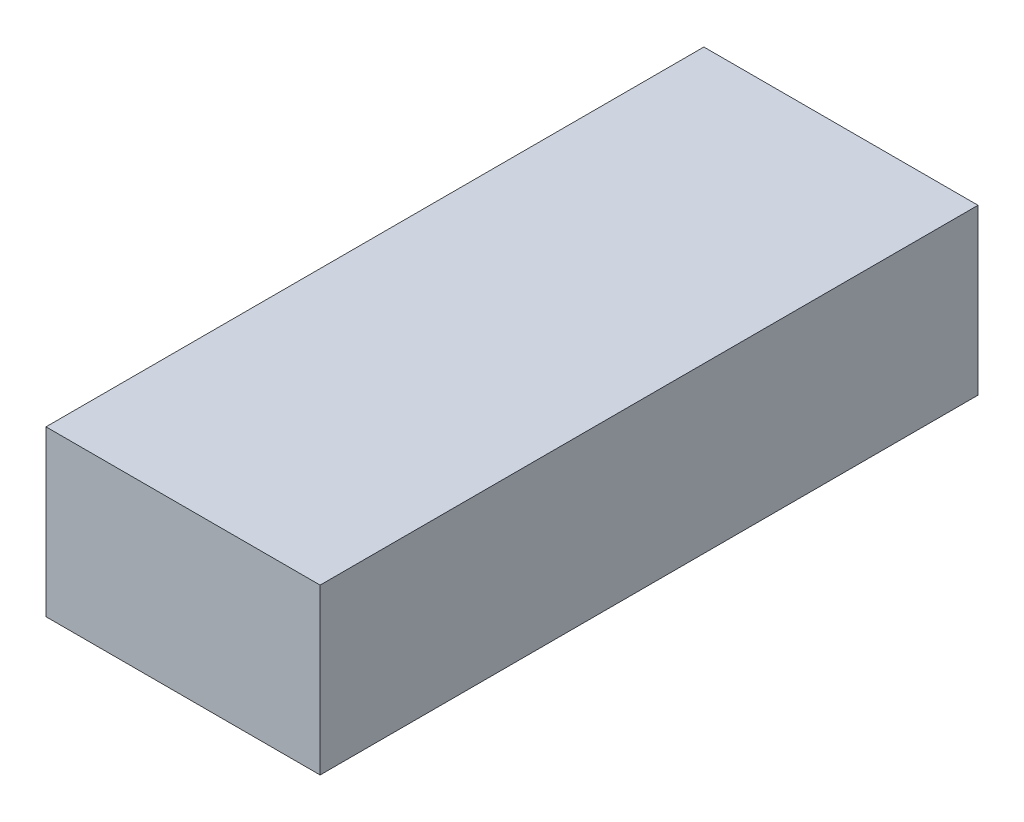
ISO-10303-21;
HEADER;
FILE_DESCRIPTION(('STEP AP214'),'2;1');
FILE_NAME('part.step','',(''),(''),'','','');
FILE_SCHEMA(('AUTOMOTIVE_DESIGN { 1 0 10303 214 1 1 1 1 }'));
ENDSEC;
DATA;
#1=APPLICATION_CONTEXT('core data for automotive mechanical design processes');
#2=APPLICATION_PROTOCOL_DEFINITION('international standard','automotive_design',2000,#1);
#3=PRODUCT_CONTEXT('',#1,'mechanical');
#4=PRODUCT('Part','Part','',(#3));
#5=PRODUCT_RELATED_PRODUCT_CATEGORY('part','',(#4));
#6=PRODUCT_DEFINITION_FORMATION('','',#4);
#7=PRODUCT_DEFINITION_CONTEXT('part definition',#1,'design');
#8=PRODUCT_DEFINITION('design','',#6,#7);
#9=PRODUCT_DEFINITION_SHAPE('','',#8);
#10=(LENGTH_UNIT() NAMED_UNIT(*) SI_UNIT(.MILLI.,.METRE.));
#11=(NAMED_UNIT(*) PLANE_ANGLE_UNIT() SI_UNIT($,.RADIAN.));
#12=(NAMED_UNIT(*) SI_UNIT($,.STERADIAN.) SOLID_ANGLE_UNIT());
#13=UNCERTAINTY_MEASURE_WITH_UNIT(LENGTH_MEASURE(1.E-05),#10,'distance_accuracy_value','');
#14=(GEOMETRIC_REPRESENTATION_CONTEXT(3) GLOBAL_UNCERTAINTY_ASSIGNED_CONTEXT((#13)) GLOBAL_UNIT_ASSIGNED_CONTEXT((#10,
#11,#12)) REPRESENTATION_CONTEXT('',''));
#15=CARTESIAN_POINT('',(0.,0.,0.));
#16=DIRECTION('',(0.,0.,1.));
#17=DIRECTION('',(1.,0.,0.));
#18=AXIS2_PLACEMENT_3D('',#15,#16,#17);
#19=CARTESIAN_POINT('',(2.5,3.,-6.));
#20=DIRECTION('',(-1.,0.,0.));
#21=DIRECTION('',(0.,0.,1.));
#22=AXIS2_PLACEMENT_3D('',#19,#20,#21);
#23=PLANE('',#22);
#24=DIRECTION('',(0.,0.,-1.));
#25=VECTOR('',#24,1.);
#26=CARTESIAN_POINT('',(2.5,0.,-6.));
#27=LINE('',#26,#25);
#28=CARTESIAN_POINT('',(2.5,0.,6.));
#29=VERTEX_POINT('',#28);
#30=CARTESIAN_POINT('',(2.5,0.,-6.));
#31=VERTEX_POINT('',#30);
#32=EDGE_CURVE('E106',#29,#31,#27,.T.);
#33=ORIENTED_EDGE('',*,*,#32,.T.);
#34=DIRECTION('',(0.,-1.,0.));
#35=VECTOR('',#34,1.);
#36=CARTESIAN_POINT('',(2.5,3.,-6.));
#37=LINE('',#36,#35);
#38=CARTESIAN_POINT('',(2.5,3.,-6.));
#39=VERTEX_POINT('',#38);
#40=EDGE_CURVE('E11',#39,#31,#37,.T.);
#41=ORIENTED_EDGE('',*,*,#40,.F.);
#42=DIRECTION('',(0.,0.,-1.));
#43=VECTOR('',#42,1.);
#44=CARTESIAN_POINT('',(2.5,3.,-6.));
#45=LINE('',#44,#43);
#46=CARTESIAN_POINT('',(2.5,3.,6.));
#47=VERTEX_POINT('',#46);
#48=EDGE_CURVE('E94',#47,#39,#45,.T.);
#49=ORIENTED_EDGE('',*,*,#48,.F.);
#50=DIRECTION('',(0.,-1.,0.));
#51=VECTOR('',#50,1.);
#52=CARTESIAN_POINT('',(2.5,3.,6.));
#53=LINE('',#52,#51);
#54=EDGE_CURVE('E102',#47,#29,#53,.T.);
#55=ORIENTED_EDGE('',*,*,#54,.T.);
#56=EDGE_LOOP('',(#33,#41,#49,#55));
#57=FACE_BOUND('',#56,.T.);
#58=ADVANCED_FACE('F43',(#57),#23,.F.);
#59=CARTESIAN_POINT('',(-2.5,3.,-6.));
#60=DIRECTION('',(0.,0.,1.));
#61=DIRECTION('',(1.,0.,0.));
#62=AXIS2_PLACEMENT_3D('',#59,#60,#61);
#63=PLANE('',#62);
#64=DIRECTION('',(-1.,0.,0.));
#65=VECTOR('',#64,1.);
#66=CARTESIAN_POINT('',(-2.5,0.,-6.));
#67=LINE('',#66,#65);
#68=CARTESIAN_POINT('',(-2.5,0.,-6.));
#69=VERTEX_POINT('',#68);
#70=EDGE_CURVE('E98',#31,#69,#67,.T.);
#71=ORIENTED_EDGE('',*,*,#70,.T.);
#72=DIRECTION('',(0.,-1.,0.));
#73=VECTOR('',#72,1.);
#74=CARTESIAN_POINT('',(-2.5,3.,-6.));
#75=LINE('',#74,#73);
#76=CARTESIAN_POINT('',(-2.5,3.,-6.));
#77=VERTEX_POINT('',#76);
#78=EDGE_CURVE('E51',#77,#69,#75,.T.);
#79=ORIENTED_EDGE('',*,*,#78,.F.);
#80=DIRECTION('',(-1.,0.,0.));
#81=VECTOR('',#80,1.);
#82=CARTESIAN_POINT('',(-2.5,3.,-6.));
#83=LINE('',#82,#81);
#84=EDGE_CURVE('E89',#39,#77,#83,.T.);
#85=ORIENTED_EDGE('',*,*,#84,.F.);
#86=ORIENTED_EDGE('',*,*,#40,.T.);
#87=EDGE_LOOP('',(#71,#79,#85,#86));
#88=FACE_BOUND('',#87,.T.);
#89=ADVANCED_FACE('F97',(#88),#63,.F.);
#90=CARTESIAN_POINT('',(-2.5,3.,-6.));
#91=DIRECTION('',(1.,0.,0.));
#92=DIRECTION('',(0.,0.,-1.));
#93=AXIS2_PLACEMENT_3D('',#90,#91,#92);
#94=PLANE('',#93);
#95=DIRECTION('',(0.,0.,1.));
#96=VECTOR('',#95,1.);
#97=CARTESIAN_POINT('',(-2.5,0.,-6.));
#98=LINE('',#97,#96);
#99=CARTESIAN_POINT('',(-2.5,0.,6.));
#100=VERTEX_POINT('',#99);
#101=EDGE_CURVE('E76',#69,#100,#98,.T.);
#102=ORIENTED_EDGE('',*,*,#101,.T.);
#103=DIRECTION('',(0.,-1.,0.));
#104=VECTOR('',#103,1.);
#105=CARTESIAN_POINT('',(-2.5,3.,6.));
#106=LINE('',#105,#104);
#107=CARTESIAN_POINT('',(-2.5,3.,6.));
#108=VERTEX_POINT('',#107);
#109=EDGE_CURVE('E99',#108,#100,#106,.T.);
#110=ORIENTED_EDGE('',*,*,#109,.F.);
#111=DIRECTION('',(0.,0.,1.));
#112=VECTOR('',#111,1.);
#113=CARTESIAN_POINT('',(-2.5,3.,-6.));
#114=LINE('',#113,#112);
#115=EDGE_CURVE('E92',#77,#108,#114,.T.);
#116=ORIENTED_EDGE('',*,*,#115,.F.);
#117=ORIENTED_EDGE('',*,*,#78,.T.);
#118=EDGE_LOOP('',(#102,#110,#116,#117));
#119=FACE_BOUND('',#118,.T.);
#120=ADVANCED_FACE('F100',(#119),#94,.F.);
#121=CARTESIAN_POINT('',(-2.5,3.,6.));
#122=DIRECTION('',(0.,0.,-1.));
#123=DIRECTION('',(-1.,0.,0.));
#124=AXIS2_PLACEMENT_3D('',#121,#122,#123);
#125=PLANE('',#124);
#126=DIRECTION('',(1.,0.,0.));
#127=VECTOR('',#126,1.);
#128=CARTESIAN_POINT('',(-2.5,0.,6.));
#129=LINE('',#128,#127);
#130=EDGE_CURVE('E82',#100,#29,#129,.T.);
#131=ORIENTED_EDGE('',*,*,#130,.T.);
#132=ORIENTED_EDGE('',*,*,#54,.F.);
#133=DIRECTION('',(1.,0.,0.));
#134=VECTOR('',#133,1.);
#135=CARTESIAN_POINT('',(-2.5,3.,6.));
#136=LINE('',#135,#134);
#137=EDGE_CURVE('E59',#108,#47,#136,.T.);
#138=ORIENTED_EDGE('',*,*,#137,.F.);
#139=ORIENTED_EDGE('',*,*,#109,.T.);
#140=EDGE_LOOP('',(#131,#132,#138,#139));
#141=FACE_BOUND('',#140,.T.);
#142=ADVANCED_FACE('F113',(#141),#125,.F.);
#143=CARTESIAN_POINT('',(0.,3.,0.));
#144=DIRECTION('',(0.,1.,0.));
#145=DIRECTION('',(0.,0.,1.));
#146=AXIS2_PLACEMENT_3D('',#143,#144,#145);
#147=PLANE('',#146);
#148=ORIENTED_EDGE('',*,*,#48,.T.);
#149=ORIENTED_EDGE('',*,*,#84,.T.);
#150=ORIENTED_EDGE('',*,*,#115,.T.);
#151=ORIENTED_EDGE('',*,*,#137,.T.);
#152=EDGE_LOOP('',(#148,#149,#150,#151));
#153=FACE_BOUND('',#152,.T.);
#154=ADVANCED_FACE('F90',(#153),#147,.T.);
#155=CARTESIAN_POINT('',(0.,0.,0.));
#156=DIRECTION('',(0.,1.,0.));
#157=DIRECTION('',(0.,0.,1.));
#158=AXIS2_PLACEMENT_3D('',#155,#156,#157);
#159=PLANE('',#158);
#160=ORIENTED_EDGE('',*,*,#32,.F.);
#161=ORIENTED_EDGE('',*,*,#130,.F.);
#162=ORIENTED_EDGE('',*,*,#101,.F.);
#163=ORIENTED_EDGE('',*,*,#70,.F.);
#164=EDGE_LOOP('',(#160,#161,#162,#163));
#165=FACE_BOUND('',#164,.T.);
#166=ADVANCED_FACE('F116',(#165),#159,.F.);
#167=CLOSED_SHELL('',(#58,#89,#120,#142,#154,#166));
#168=MANIFOLD_SOLID_BREP('B2',#167);
#169=ADVANCED_BREP_SHAPE_REPRESENTATION('',(#18,#168),#14);
#170=SHAPE_DEFINITION_REPRESENTATION(#9,#169);
ENDSEC;
END-ISO-10303-21;
